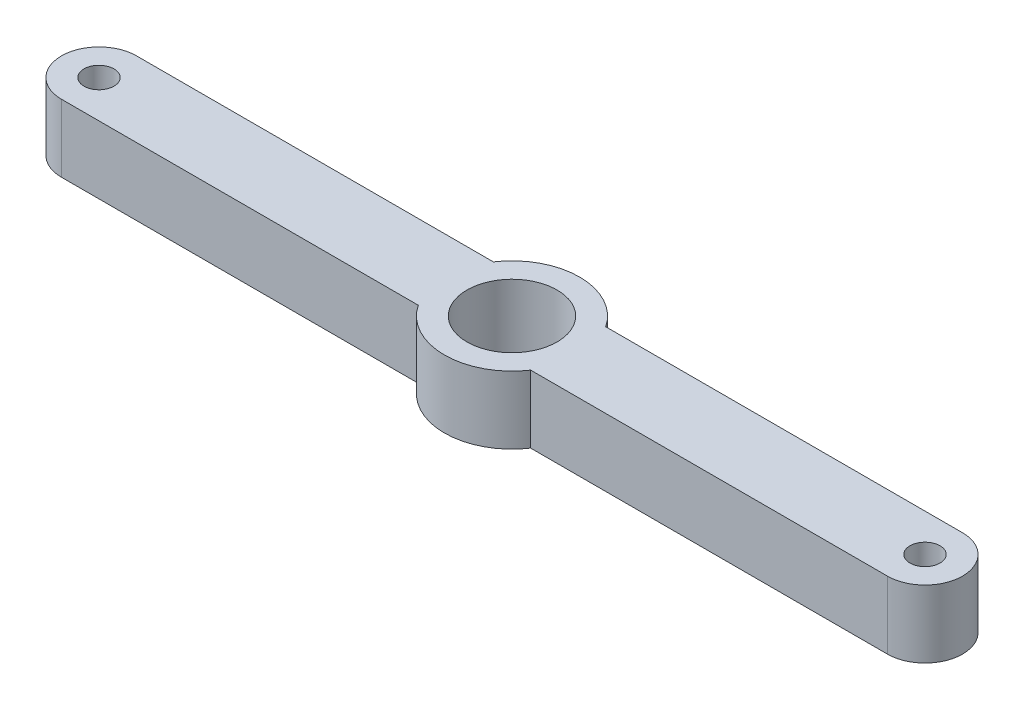
ISO-10303-21;
HEADER;
FILE_DESCRIPTION(('STEP AP214'),'2;1');
FILE_NAME('part.step','',(''),(''),'','','');
FILE_SCHEMA(('AUTOMOTIVE_DESIGN { 1 0 10303 214 1 1 1 1 }'));
ENDSEC;
DATA;
#1=APPLICATION_CONTEXT('core data for automotive mechanical design processes');
#2=APPLICATION_PROTOCOL_DEFINITION('international standard','automotive_design',2000,#1);
#3=PRODUCT_CONTEXT('',#1,'mechanical');
#4=PRODUCT('Part','Part','',(#3));
#5=PRODUCT_RELATED_PRODUCT_CATEGORY('part','',(#4));
#6=PRODUCT_DEFINITION_FORMATION('','',#4);
#7=PRODUCT_DEFINITION_CONTEXT('part definition',#1,'design');
#8=PRODUCT_DEFINITION('design','',#6,#7);
#9=PRODUCT_DEFINITION_SHAPE('','',#8);
#10=(LENGTH_UNIT() NAMED_UNIT(*) SI_UNIT(.MILLI.,.METRE.));
#11=(NAMED_UNIT(*) PLANE_ANGLE_UNIT() SI_UNIT($,.RADIAN.));
#12=(NAMED_UNIT(*) SI_UNIT($,.STERADIAN.) SOLID_ANGLE_UNIT());
#13=UNCERTAINTY_MEASURE_WITH_UNIT(LENGTH_MEASURE(1.E-05),#10,'distance_accuracy_value','');
#14=(GEOMETRIC_REPRESENTATION_CONTEXT(3) GLOBAL_UNCERTAINTY_ASSIGNED_CONTEXT((#13)) GLOBAL_UNIT_ASSIGNED_CONTEXT((#10,
#11,#12)) REPRESENTATION_CONTEXT('',''));
#15=CARTESIAN_POINT('',(0.,0.,0.));
#16=DIRECTION('',(0.,0.,1.));
#17=DIRECTION('',(1.,0.,0.));
#18=AXIS2_PLACEMENT_3D('',#15,#16,#17);
#19=CARTESIAN_POINT('',(-27.5,4.5,0.));
#20=DIRECTION('',(0.,-1.,0.));
#21=DIRECTION('',(0.,0.,-1.));
#22=AXIS2_PLACEMENT_3D('',#19,#20,#21);
#23=CYLINDRICAL_SURFACE('',#22,2.5);
#24=CARTESIAN_POINT('',(-27.5,0.,0.));
#25=DIRECTION('',(0.,1.,0.));
#26=DIRECTION('',(0.,0.,1.));
#27=AXIS2_PLACEMENT_3D('',#24,#25,#26);
#28=CIRCLE('',#27,2.5);
#29=CARTESIAN_POINT('',(-27.5,0.,-2.5));
#30=VERTEX_POINT('',#29);
#31=CARTESIAN_POINT('',(-27.5,0.,2.50000000000001));
#32=VERTEX_POINT('',#31);
#33=EDGE_CURVE('E137',#30,#32,#28,.T.);
#34=ORIENTED_EDGE('',*,*,#33,.T.);
#35=DIRECTION('',(0.,-1.,0.));
#36=VECTOR('',#35,1.);
#37=CARTESIAN_POINT('',(-27.5,4.5,2.50000000000001));
#38=LINE('',#37,#36);
#39=CARTESIAN_POINT('',(-27.5,4.5,2.50000000000001));
#40=VERTEX_POINT('',#39);
#41=EDGE_CURVE('E11',#40,#32,#38,.T.);
#42=ORIENTED_EDGE('',*,*,#41,.F.);
#43=CARTESIAN_POINT('',(-27.5,4.5,0.));
#44=DIRECTION('',(0.,1.,0.));
#45=DIRECTION('',(0.,0.,1.));
#46=AXIS2_PLACEMENT_3D('',#43,#44,#45);
#47=CIRCLE('',#46,2.5);
#48=CARTESIAN_POINT('',(-27.5,4.5,-2.5));
#49=VERTEX_POINT('',#48);
#50=EDGE_CURVE('E152',#49,#40,#47,.T.);
#51=ORIENTED_EDGE('',*,*,#50,.F.);
#52=DIRECTION('',(0.,-1.,0.));
#53=VECTOR('',#52,1.);
#54=CARTESIAN_POINT('',(-27.5,4.5,-2.5));
#55=LINE('',#54,#53);
#56=EDGE_CURVE('E133',#49,#30,#55,.T.);
#57=ORIENTED_EDGE('',*,*,#56,.T.);
#58=EDGE_LOOP('',(#34,#42,#51,#57));
#59=FACE_BOUND('',#58,.T.);
#60=ADVANCED_FACE('F39',(#59),#23,.T.);
#61=CARTESIAN_POINT('',(-3.74165738677395,4.5,2.5));
#62=DIRECTION('',(0.,0.,-1.));
#63=DIRECTION('',(-1.,0.,0.));
#64=AXIS2_PLACEMENT_3D('',#61,#62,#63);
#65=PLANE('',#64);
#66=DIRECTION('',(1.,0.,0.));
#67=VECTOR('',#66,1.);
#68=CARTESIAN_POINT('',(-3.74165738677395,0.,2.5));
#69=LINE('',#68,#67);
#70=CARTESIAN_POINT('',(-3.74165738677395,0.,2.5));
#71=VERTEX_POINT('',#70);
#72=EDGE_CURVE('E140',#32,#71,#69,.T.);
#73=ORIENTED_EDGE('',*,*,#72,.T.);
#74=DIRECTION('',(0.,-1.,0.));
#75=VECTOR('',#74,1.);
#76=CARTESIAN_POINT('',(-3.74165738677395,4.5,2.5));
#77=LINE('',#76,#75);
#78=CARTESIAN_POINT('',(-3.74165738677395,4.5,2.5));
#79=VERTEX_POINT('',#78);
#80=EDGE_CURVE('E48',#79,#71,#77,.T.);
#81=ORIENTED_EDGE('',*,*,#80,.F.);
#82=DIRECTION('',(1.,0.,0.));
#83=VECTOR('',#82,1.);
#84=CARTESIAN_POINT('',(-3.74165738677395,4.5,2.5));
#85=LINE('',#84,#83);
#86=EDGE_CURVE('E100',#40,#79,#85,.T.);
#87=ORIENTED_EDGE('',*,*,#86,.F.);
#88=ORIENTED_EDGE('',*,*,#41,.T.);
#89=EDGE_LOOP('',(#73,#81,#87,#88));
#90=FACE_BOUND('',#89,.T.);
#91=ADVANCED_FACE('F217',(#90),#65,.F.);
#92=CARTESIAN_POINT('',(0.,4.5,0.));
#93=DIRECTION('',(0.,-1.,0.));
#94=DIRECTION('',(0.,0.,-1.));
#95=AXIS2_PLACEMENT_3D('',#92,#93,#94);
#96=CYLINDRICAL_SURFACE('',#95,4.5);
#97=CARTESIAN_POINT('',(0.,0.,0.));
#98=DIRECTION('',(0.,1.,0.));
#99=DIRECTION('',(0.,0.,1.));
#100=AXIS2_PLACEMENT_3D('',#97,#98,#99);
#101=CIRCLE('',#100,4.5);
#102=CARTESIAN_POINT('',(3.74165738677393,0.,2.5));
#103=VERTEX_POINT('',#102);
#104=EDGE_CURVE('E143',#71,#103,#101,.T.);
#105=ORIENTED_EDGE('',*,*,#104,.T.);
#106=DIRECTION('',(0.,-1.,0.));
#107=VECTOR('',#106,1.);
#108=CARTESIAN_POINT('',(3.74165738677393,4.5,2.5));
#109=LINE('',#108,#107);
#110=CARTESIAN_POINT('',(3.74165738677393,4.5,2.5));
#111=VERTEX_POINT('',#110);
#112=EDGE_CURVE('E159',#111,#103,#109,.T.);
#113=ORIENTED_EDGE('',*,*,#112,.F.);
#114=CARTESIAN_POINT('',(0.,4.5,0.));
#115=DIRECTION('',(0.,1.,0.));
#116=DIRECTION('',(0.,0.,1.));
#117=AXIS2_PLACEMENT_3D('',#114,#115,#116);
#118=CIRCLE('',#117,4.5);
#119=EDGE_CURVE('E184',#79,#111,#118,.T.);
#120=ORIENTED_EDGE('',*,*,#119,.F.);
#121=ORIENTED_EDGE('',*,*,#80,.T.);
#122=EDGE_LOOP('',(#105,#113,#120,#121));
#123=FACE_BOUND('',#122,.T.);
#124=ADVANCED_FACE('F221',(#123),#96,.T.);
#125=CARTESIAN_POINT('',(27.5,4.5,2.5));
#126=DIRECTION('',(0.,0.,-1.));
#127=DIRECTION('',(-1.,0.,0.));
#128=AXIS2_PLACEMENT_3D('',#125,#126,#127);
#129=PLANE('',#128);
#130=DIRECTION('',(1.,0.,0.));
#131=VECTOR('',#130,1.);
#132=CARTESIAN_POINT('',(27.5,0.,2.5));
#133=LINE('',#132,#131);
#134=CARTESIAN_POINT('',(27.5,0.,2.5));
#135=VERTEX_POINT('',#134);
#136=EDGE_CURVE('E145',#103,#135,#133,.T.);
#137=ORIENTED_EDGE('',*,*,#136,.T.);
#138=DIRECTION('',(0.,-1.,0.));
#139=VECTOR('',#138,1.);
#140=CARTESIAN_POINT('',(27.5,4.5,2.5));
#141=LINE('',#140,#139);
#142=CARTESIAN_POINT('',(27.5,4.5,2.5));
#143=VERTEX_POINT('',#142);
#144=EDGE_CURVE('E156',#143,#135,#141,.T.);
#145=ORIENTED_EDGE('',*,*,#144,.F.);
#146=DIRECTION('',(1.,0.,0.));
#147=VECTOR('',#146,1.);
#148=CARTESIAN_POINT('',(27.5,4.5,2.5));
#149=LINE('',#148,#147);
#150=EDGE_CURVE('E186',#111,#143,#149,.T.);
#151=ORIENTED_EDGE('',*,*,#150,.F.);
#152=ORIENTED_EDGE('',*,*,#112,.T.);
#153=EDGE_LOOP('',(#137,#145,#151,#152));
#154=FACE_BOUND('',#153,.T.);
#155=ADVANCED_FACE('F192',(#154),#129,.F.);
#156=CARTESIAN_POINT('',(27.5,4.5,0.));
#157=DIRECTION('',(0.,-1.,0.));
#158=DIRECTION('',(0.,0.,-1.));
#159=AXIS2_PLACEMENT_3D('',#156,#157,#158);
#160=CYLINDRICAL_SURFACE('',#159,2.5);
#161=CARTESIAN_POINT('',(27.5,0.,0.));
#162=DIRECTION('',(0.,1.,0.));
#163=DIRECTION('',(0.,0.,-1.));
#164=AXIS2_PLACEMENT_3D('',#161,#162,#163);
#165=CIRCLE('',#164,2.5);
#166=CARTESIAN_POINT('',(27.5,0.,-2.5));
#167=VERTEX_POINT('',#166);
#168=EDGE_CURVE('E147',#135,#167,#165,.T.);
#169=ORIENTED_EDGE('',*,*,#168,.T.);
#170=DIRECTION('',(0.,-1.,0.));
#171=VECTOR('',#170,1.);
#172=CARTESIAN_POINT('',(27.5,4.5,-2.5));
#173=LINE('',#172,#171);
#174=CARTESIAN_POINT('',(27.5,4.5,-2.5));
#175=VERTEX_POINT('',#174);
#176=EDGE_CURVE('E128',#175,#167,#173,.T.);
#177=ORIENTED_EDGE('',*,*,#176,.F.);
#178=CARTESIAN_POINT('',(27.5,4.5,0.));
#179=DIRECTION('',(0.,1.,0.));
#180=DIRECTION('',(0.,0.,-1.));
#181=AXIS2_PLACEMENT_3D('',#178,#179,#180);
#182=CIRCLE('',#181,2.5);
#183=EDGE_CURVE('E119',#143,#175,#182,.T.);
#184=ORIENTED_EDGE('',*,*,#183,.F.);
#185=ORIENTED_EDGE('',*,*,#144,.T.);
#186=EDGE_LOOP('',(#169,#177,#184,#185));
#187=FACE_BOUND('',#186,.T.);
#188=ADVANCED_FACE('F196',(#187),#160,.T.);
#189=CARTESIAN_POINT('',(27.5,4.5,-2.5));
#190=DIRECTION('',(0.,0.,1.));
#191=DIRECTION('',(1.,0.,0.));
#192=AXIS2_PLACEMENT_3D('',#189,#190,#191);
#193=PLANE('',#192);
#194=DIRECTION('',(-1.,0.,0.));
#195=VECTOR('',#194,1.);
#196=CARTESIAN_POINT('',(27.5,0.,-2.5));
#197=LINE('',#196,#195);
#198=CARTESIAN_POINT('',(3.74165738677394,0.,-2.5));
#199=VERTEX_POINT('',#198);
#200=EDGE_CURVE('E127',#167,#199,#197,.T.);
#201=ORIENTED_EDGE('',*,*,#200,.T.);
#202=DIRECTION('',(0.,-1.,0.));
#203=VECTOR('',#202,1.);
#204=CARTESIAN_POINT('',(3.74165738677394,4.5,-2.5));
#205=LINE('',#204,#203);
#206=CARTESIAN_POINT('',(3.74165738677394,4.5,-2.5));
#207=VERTEX_POINT('',#206);
#208=EDGE_CURVE('E124',#207,#199,#205,.T.);
#209=ORIENTED_EDGE('',*,*,#208,.F.);
#210=DIRECTION('',(-1.,0.,0.));
#211=VECTOR('',#210,1.);
#212=CARTESIAN_POINT('',(27.5,4.5,-2.5));
#213=LINE('',#212,#211);
#214=EDGE_CURVE('E113',#175,#207,#213,.T.);
#215=ORIENTED_EDGE('',*,*,#214,.F.);
#216=ORIENTED_EDGE('',*,*,#176,.T.);
#217=EDGE_LOOP('',(#201,#209,#215,#216));
#218=FACE_BOUND('',#217,.T.);
#219=ADVANCED_FACE('F125',(#218),#193,.F.);
#220=CARTESIAN_POINT('',(0.,4.5,0.));
#221=DIRECTION('',(0.,-1.,0.));
#222=DIRECTION('',(0.,0.,-1.));
#223=AXIS2_PLACEMENT_3D('',#220,#221,#222);
#224=CYLINDRICAL_SURFACE('',#223,4.5);
#225=CARTESIAN_POINT('',(0.,0.,0.));
#226=DIRECTION('',(0.,1.,0.));
#227=DIRECTION('',(0.,0.,1.));
#228=AXIS2_PLACEMENT_3D('',#225,#226,#227);
#229=CIRCLE('',#228,4.5);
#230=CARTESIAN_POINT('',(-3.74165738677395,0.,-2.5));
#231=VERTEX_POINT('',#230);
#232=EDGE_CURVE('E86',#199,#231,#229,.T.);
#233=ORIENTED_EDGE('',*,*,#232,.T.);
#234=DIRECTION('',(0.,-1.,0.));
#235=VECTOR('',#234,1.);
#236=CARTESIAN_POINT('',(-3.74165738677395,4.5,-2.5));
#237=LINE('',#236,#235);
#238=CARTESIAN_POINT('',(-3.74165738677395,4.5,-2.5));
#239=VERTEX_POINT('',#238);
#240=EDGE_CURVE('E129',#239,#231,#237,.T.);
#241=ORIENTED_EDGE('',*,*,#240,.F.);
#242=CARTESIAN_POINT('',(0.,4.5,0.));
#243=DIRECTION('',(0.,1.,0.));
#244=DIRECTION('',(0.,0.,1.));
#245=AXIS2_PLACEMENT_3D('',#242,#243,#244);
#246=CIRCLE('',#245,4.5);
#247=EDGE_CURVE('E117',#207,#239,#246,.T.);
#248=ORIENTED_EDGE('',*,*,#247,.F.);
#249=ORIENTED_EDGE('',*,*,#208,.T.);
#250=EDGE_LOOP('',(#233,#241,#248,#249));
#251=FACE_BOUND('',#250,.T.);
#252=ADVANCED_FACE('F131',(#251),#224,.T.);
#253=CARTESIAN_POINT('',(-3.74165738677395,4.5,-2.5));
#254=DIRECTION('',(0.,0.,1.));
#255=DIRECTION('',(1.,0.,0.));
#256=AXIS2_PLACEMENT_3D('',#253,#254,#255);
#257=PLANE('',#256);
#258=DIRECTION('',(-1.,0.,0.));
#259=VECTOR('',#258,1.);
#260=CARTESIAN_POINT('',(-3.74165738677395,0.,-2.5));
#261=LINE('',#260,#259);
#262=EDGE_CURVE('E92',#231,#30,#261,.T.);
#263=ORIENTED_EDGE('',*,*,#262,.T.);
#264=ORIENTED_EDGE('',*,*,#56,.F.);
#265=DIRECTION('',(-1.,0.,0.));
#266=VECTOR('',#265,1.);
#267=CARTESIAN_POINT('',(-3.74165738677395,4.5,-2.5));
#268=LINE('',#267,#266);
#269=EDGE_CURVE('E57',#239,#49,#268,.T.);
#270=ORIENTED_EDGE('',*,*,#269,.F.);
#271=ORIENTED_EDGE('',*,*,#240,.T.);
#272=EDGE_LOOP('',(#263,#264,#270,#271));
#273=FACE_BOUND('',#272,.T.);
#274=ADVANCED_FACE('F204',(#273),#257,.F.);
#275=CARTESIAN_POINT('',(-27.5,4.5,0.));
#276=DIRECTION('',(0.,1.,0.));
#277=DIRECTION('',(0.,0.,1.));
#278=AXIS2_PLACEMENT_3D('',#275,#276,#277);
#279=PLANE('',#278);
#280=CARTESIAN_POINT('',(-27.5,4.5,0.));
#281=DIRECTION('',(0.,1.,0.));
#282=DIRECTION('',(0.,0.,1.));
#283=AXIS2_PLACEMENT_3D('',#280,#281,#282);
#284=CIRCLE('',#283,1.);
#285=CARTESIAN_POINT('',(-27.5,4.5,1.));
#286=VERTEX_POINT('',#285);
#287=EDGE_CURVE('E168',#286,#286,#284,.T.);
#288=ORIENTED_EDGE('',*,*,#287,.F.);
#289=EDGE_LOOP('',(#288));
#290=FACE_BOUND('',#289,.T.);
#291=CARTESIAN_POINT('',(27.5,4.5,0.));
#292=DIRECTION('',(0.,1.,0.));
#293=DIRECTION('',(0.,0.,-1.));
#294=AXIS2_PLACEMENT_3D('',#291,#292,#293);
#295=CIRCLE('',#294,1.);
#296=CARTESIAN_POINT('',(27.5,4.5,-1.));
#297=VERTEX_POINT('',#296);
#298=EDGE_CURVE('E173',#297,#297,#295,.T.);
#299=ORIENTED_EDGE('',*,*,#298,.F.);
#300=EDGE_LOOP('',(#299));
#301=FACE_BOUND('',#300,.T.);
#302=CARTESIAN_POINT('',(0.,4.5,0.));
#303=DIRECTION('',(0.,1.,0.));
#304=DIRECTION('',(0.,0.,1.));
#305=AXIS2_PLACEMENT_3D('',#302,#303,#304);
#306=CIRCLE('',#305,3.);
#307=CARTESIAN_POINT('',(0.,4.5,3.));
#308=VERTEX_POINT('',#307);
#309=EDGE_CURVE('E165',#308,#308,#306,.T.);
#310=ORIENTED_EDGE('',*,*,#309,.F.);
#311=EDGE_LOOP('',(#310));
#312=FACE_BOUND('',#311,.T.);
#313=ORIENTED_EDGE('',*,*,#50,.T.);
#314=ORIENTED_EDGE('',*,*,#86,.T.);
#315=ORIENTED_EDGE('',*,*,#119,.T.);
#316=ORIENTED_EDGE('',*,*,#150,.T.);
#317=ORIENTED_EDGE('',*,*,#183,.T.);
#318=ORIENTED_EDGE('',*,*,#214,.T.);
#319=ORIENTED_EDGE('',*,*,#247,.T.);
#320=ORIENTED_EDGE('',*,*,#269,.T.);
#321=EDGE_LOOP('',(#313,#314,#315,#316,#317,#318,#319,#320));
#322=FACE_BOUND('',#321,.T.);
#323=ADVANCED_FACE('F115',(#290,#301,#312,#322),#279,.T.);
#324=CARTESIAN_POINT('',(-27.5,0.,0.));
#325=DIRECTION('',(0.,1.,0.));
#326=DIRECTION('',(0.,0.,1.));
#327=AXIS2_PLACEMENT_3D('',#324,#325,#326);
#328=PLANE('',#327);
#329=CARTESIAN_POINT('',(-27.5,0.,0.));
#330=DIRECTION('',(0.,1.,0.));
#331=DIRECTION('',(0.,0.,1.));
#332=AXIS2_PLACEMENT_3D('',#329,#330,#331);
#333=CIRCLE('',#332,1.);
#334=CARTESIAN_POINT('',(-27.5,0.,1.));
#335=VERTEX_POINT('',#334);
#336=EDGE_CURVE('E42',#335,#335,#333,.T.);
#337=ORIENTED_EDGE('',*,*,#336,.T.);
#338=EDGE_LOOP('',(#337));
#339=FACE_BOUND('',#338,.T.);
#340=CARTESIAN_POINT('',(27.5,0.,0.));
#341=DIRECTION('',(0.,1.,0.));
#342=DIRECTION('',(0.,0.,1.));
#343=AXIS2_PLACEMENT_3D('',#340,#341,#342);
#344=CIRCLE('',#343,1.);
#345=CARTESIAN_POINT('',(27.5,0.,1.));
#346=VERTEX_POINT('',#345);
#347=EDGE_CURVE('E166',#346,#346,#344,.T.);
#348=ORIENTED_EDGE('',*,*,#347,.T.);
#349=EDGE_LOOP('',(#348));
#350=FACE_BOUND('',#349,.T.);
#351=CARTESIAN_POINT('',(0.,0.,0.));
#352=DIRECTION('',(0.,1.,0.));
#353=DIRECTION('',(0.,0.,1.));
#354=AXIS2_PLACEMENT_3D('',#351,#352,#353);
#355=CIRCLE('',#354,3.);
#356=CARTESIAN_POINT('',(0.,0.,3.));
#357=VERTEX_POINT('',#356);
#358=EDGE_CURVE('E141',#357,#357,#355,.T.);
#359=ORIENTED_EDGE('',*,*,#358,.T.);
#360=EDGE_LOOP('',(#359));
#361=FACE_BOUND('',#360,.T.);
#362=ORIENTED_EDGE('',*,*,#33,.F.);
#363=ORIENTED_EDGE('',*,*,#262,.F.);
#364=ORIENTED_EDGE('',*,*,#232,.F.);
#365=ORIENTED_EDGE('',*,*,#200,.F.);
#366=ORIENTED_EDGE('',*,*,#168,.F.);
#367=ORIENTED_EDGE('',*,*,#136,.F.);
#368=ORIENTED_EDGE('',*,*,#104,.F.);
#369=ORIENTED_EDGE('',*,*,#72,.F.);
#370=EDGE_LOOP('',(#362,#363,#364,#365,#366,#367,#368,#369));
#371=FACE_BOUND('',#370,.T.);
#372=ADVANCED_FACE('F199',(#339,#350,#361,#371),#328,.F.);
#373=CARTESIAN_POINT('',(0.,-1.2E-05,0.));
#374=DIRECTION('',(0.,1.,0.));
#375=DIRECTION('',(0.,0.,1.));
#376=AXIS2_PLACEMENT_3D('',#373,#374,#375);
#377=CYLINDRICAL_SURFACE('',#376,3.);
#378=ORIENTED_EDGE('',*,*,#309,.T.);
#379=EDGE_LOOP('',(#378));
#380=FACE_BOUND('',#379,.T.);
#381=ORIENTED_EDGE('',*,*,#358,.F.);
#382=EDGE_LOOP('',(#381));
#383=FACE_BOUND('',#382,.T.);
#384=ADVANCED_FACE('F262',(#380,#383),#377,.F.);
#385=CARTESIAN_POINT('',(27.5,-1.2E-05,0.));
#386=DIRECTION('',(0.,1.,0.));
#387=DIRECTION('',(0.,0.,1.));
#388=AXIS2_PLACEMENT_3D('',#385,#386,#387);
#389=CYLINDRICAL_SURFACE('',#388,1.);
#390=ORIENTED_EDGE('',*,*,#298,.T.);
#391=EDGE_LOOP('',(#390));
#392=FACE_BOUND('',#391,.T.);
#393=ORIENTED_EDGE('',*,*,#347,.F.);
#394=EDGE_LOOP('',(#393));
#395=FACE_BOUND('',#394,.T.);
#396=ADVANCED_FACE('F271',(#392,#395),#389,.F.);
#397=CARTESIAN_POINT('',(-27.5,-1.2E-05,0.));
#398=DIRECTION('',(0.,1.,0.));
#399=DIRECTION('',(0.,0.,1.));
#400=AXIS2_PLACEMENT_3D('',#397,#398,#399);
#401=CYLINDRICAL_SURFACE('',#400,1.);
#402=ORIENTED_EDGE('',*,*,#287,.T.);
#403=EDGE_LOOP('',(#402));
#404=FACE_BOUND('',#403,.T.);
#405=ORIENTED_EDGE('',*,*,#336,.F.);
#406=EDGE_LOOP('',(#405));
#407=FACE_BOUND('',#406,.T.);
#408=ADVANCED_FACE('F280',(#404,#407),#401,.F.);
#409=CLOSED_SHELL('',(#60,#91,#124,#155,#188,#219,#252,#274,#323,#372,#384,#396,#408));
#410=MANIFOLD_SOLID_BREP('B2',#409);
#411=ADVANCED_BREP_SHAPE_REPRESENTATION('',(#18,#410),#14);
#412=SHAPE_DEFINITION_REPRESENTATION(#9,#411);
ENDSEC;
END-ISO-10303-21;
